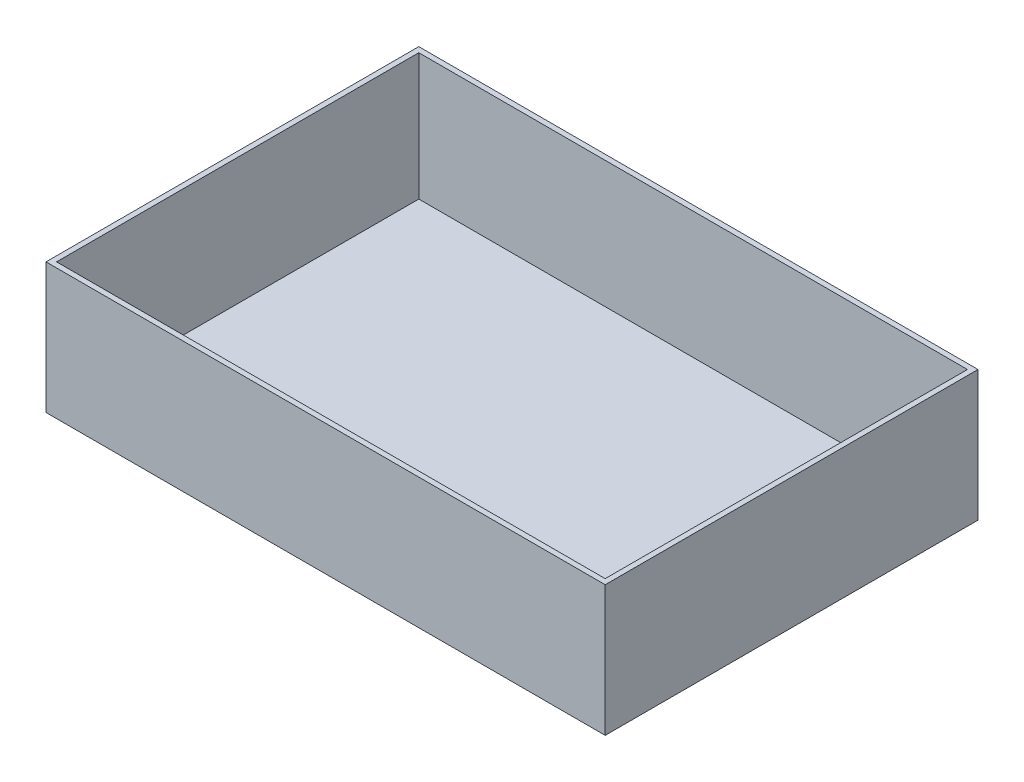
ISO-10303-21;
HEADER;
FILE_DESCRIPTION(('STEP AP214'),'2;1');
FILE_NAME('part.step','',(''),(''),'','','');
FILE_SCHEMA(('AUTOMOTIVE_DESIGN { 1 0 10303 214 1 1 1 1 }'));
ENDSEC;
DATA;
#1=APPLICATION_CONTEXT('core data for automotive mechanical design processes');
#2=APPLICATION_PROTOCOL_DEFINITION('international standard','automotive_design',2000,#1);
#3=PRODUCT_CONTEXT('',#1,'mechanical');
#4=PRODUCT('Part','Part','',(#3));
#5=PRODUCT_RELATED_PRODUCT_CATEGORY('part','',(#4));
#6=PRODUCT_DEFINITION_FORMATION('','',#4);
#7=PRODUCT_DEFINITION_CONTEXT('part definition',#1,'design');
#8=PRODUCT_DEFINITION('design','',#6,#7);
#9=PRODUCT_DEFINITION_SHAPE('','',#8);
#10=(LENGTH_UNIT() NAMED_UNIT(*) SI_UNIT(.MILLI.,.METRE.));
#11=(NAMED_UNIT(*) PLANE_ANGLE_UNIT() SI_UNIT($,.RADIAN.));
#12=(NAMED_UNIT(*) SI_UNIT($,.STERADIAN.) SOLID_ANGLE_UNIT());
#13=UNCERTAINTY_MEASURE_WITH_UNIT(LENGTH_MEASURE(1.E-05),#10,'distance_accuracy_value','');
#14=(GEOMETRIC_REPRESENTATION_CONTEXT(3) GLOBAL_UNCERTAINTY_ASSIGNED_CONTEXT((#13)) GLOBAL_UNIT_ASSIGNED_CONTEXT((#10,
#11,#12)) REPRESENTATION_CONTEXT('',''));
#15=CARTESIAN_POINT('',(0.,0.,0.));
#16=DIRECTION('',(0.,0.,1.));
#17=DIRECTION('',(1.,0.,0.));
#18=AXIS2_PLACEMENT_3D('',#15,#16,#17);
#19=CARTESIAN_POINT('',(0.,700.,0.));
#20=DIRECTION('',(0.,-1.,0.));
#21=DIRECTION('',(0.,0.,-1.));
#22=AXIS2_PLACEMENT_3D('',#19,#20,#21);
#23=PLANE('',#22);
#24=DIRECTION('',(0.,0.,1.));
#25=VECTOR('',#24,1.);
#26=CARTESIAN_POINT('',(0.,700.,0.));
#27=LINE('',#26,#25);
#28=CARTESIAN_POINT('',(0.,700.,-2000.));
#29=VERTEX_POINT('',#28);
#30=CARTESIAN_POINT('',(0.,700.,0.));
#31=VERTEX_POINT('',#30);
#32=EDGE_CURVE('E154',#29,#31,#27,.T.);
#33=ORIENTED_EDGE('',*,*,#32,.T.);
#34=DIRECTION('',(1.,0.,0.));
#35=VECTOR('',#34,1.);
#36=CARTESIAN_POINT('',(0.,700.,0.));
#37=LINE('',#36,#35);
#38=CARTESIAN_POINT('',(3000.,700.,0.));
#39=VERTEX_POINT('',#38);
#40=EDGE_CURVE('E158',#31,#39,#37,.T.);
#41=ORIENTED_EDGE('',*,*,#40,.T.);
#42=DIRECTION('',(0.,0.,-1.));
#43=VECTOR('',#42,1.);
#44=CARTESIAN_POINT('',(3000.,700.,0.));
#45=LINE('',#44,#43);
#46=CARTESIAN_POINT('',(3000.,700.,-2000.));
#47=VERTEX_POINT('',#46);
#48=EDGE_CURVE('E162',#39,#47,#45,.T.);
#49=ORIENTED_EDGE('',*,*,#48,.T.);
#50=DIRECTION('',(-1.,0.,0.));
#51=VECTOR('',#50,1.);
#52=CARTESIAN_POINT('',(0.,700.,-2000.));
#53=LINE('',#52,#51);
#54=EDGE_CURVE('E165',#47,#29,#53,.T.);
#55=ORIENTED_EDGE('',*,*,#54,.T.);
#56=EDGE_LOOP('',(#33,#41,#49,#55));
#57=FACE_BOUND('',#56,.T.);
#58=DIRECTION('',(0.,0.,-1.));
#59=VECTOR('',#58,1.);
#60=CARTESIAN_POINT('',(2971.71572875254,700.,-28.284271247462));
#61=LINE('',#60,#59);
#62=CARTESIAN_POINT('',(2971.71572875254,700.,-28.284271247462));
#63=VERTEX_POINT('',#62);
#64=CARTESIAN_POINT('',(2971.71572875254,700.,-1971.71572875254));
#65=VERTEX_POINT('',#64);
#66=EDGE_CURVE('E134',#63,#65,#61,.T.);
#67=ORIENTED_EDGE('',*,*,#66,.F.);
#68=DIRECTION('',(1.,0.,0.));
#69=VECTOR('',#68,1.);
#70=CARTESIAN_POINT('',(28.2842712474618,700.,-28.284271247462));
#71=LINE('',#70,#69);
#72=CARTESIAN_POINT('',(28.2842712474618,700.,-28.284271247462));
#73=VERTEX_POINT('',#72);
#74=EDGE_CURVE('E113',#73,#63,#71,.T.);
#75=ORIENTED_EDGE('',*,*,#74,.F.);
#76=DIRECTION('',(0.,0.,1.));
#77=VECTOR('',#76,1.);
#78=CARTESIAN_POINT('',(28.2842712474618,700.,-28.284271247462));
#79=LINE('',#78,#77);
#80=CARTESIAN_POINT('',(28.2842712474618,700.,-1971.71572875254));
#81=VERTEX_POINT('',#80);
#82=EDGE_CURVE('E140',#81,#73,#79,.T.);
#83=ORIENTED_EDGE('',*,*,#82,.F.);
#84=DIRECTION('',(-1.,0.,0.));
#85=VECTOR('',#84,1.);
#86=CARTESIAN_POINT('',(28.2842712474618,700.,-1971.71572875254));
#87=LINE('',#86,#85);
#88=EDGE_CURVE('E137',#65,#81,#87,.T.);
#89=ORIENTED_EDGE('',*,*,#88,.F.);
#90=EDGE_LOOP('',(#67,#75,#83,#89));
#91=FACE_BOUND('',#90,.T.);
#92=ADVANCED_FACE('F39',(#57,#91),#23,.F.);
#93=CARTESIAN_POINT('',(0.,0.,0.));
#94=DIRECTION('',(0.,-1.,0.));
#95=DIRECTION('',(0.,0.,-1.));
#96=AXIS2_PLACEMENT_3D('',#93,#94,#95);
#97=PLANE('',#96);
#98=DIRECTION('',(0.,0.,1.));
#99=VECTOR('',#98,1.);
#100=CARTESIAN_POINT('',(0.,0.,0.));
#101=LINE('',#100,#99);
#102=CARTESIAN_POINT('',(0.,0.,-2000.));
#103=VERTEX_POINT('',#102);
#104=CARTESIAN_POINT('',(0.,0.,0.));
#105=VERTEX_POINT('',#104);
#106=EDGE_CURVE('E153',#103,#105,#101,.T.);
#107=ORIENTED_EDGE('',*,*,#106,.F.);
#108=DIRECTION('',(-1.,0.,0.));
#109=VECTOR('',#108,1.);
#110=CARTESIAN_POINT('',(0.,0.,-2000.));
#111=LINE('',#110,#109);
#112=CARTESIAN_POINT('',(3000.,0.,-2000.));
#113=VERTEX_POINT('',#112);
#114=EDGE_CURVE('E159',#113,#103,#111,.T.);
#115=ORIENTED_EDGE('',*,*,#114,.F.);
#116=DIRECTION('',(0.,0.,-1.));
#117=VECTOR('',#116,1.);
#118=CARTESIAN_POINT('',(3000.,0.,0.));
#119=LINE('',#118,#117);
#120=CARTESIAN_POINT('',(3000.,0.,0.));
#121=VERTEX_POINT('',#120);
#122=EDGE_CURVE('E175',#121,#113,#119,.T.);
#123=ORIENTED_EDGE('',*,*,#122,.F.);
#124=DIRECTION('',(1.,0.,0.));
#125=VECTOR('',#124,1.);
#126=CARTESIAN_POINT('',(0.,0.,0.));
#127=LINE('',#126,#125);
#128=EDGE_CURVE('E172',#105,#121,#127,.T.);
#129=ORIENTED_EDGE('',*,*,#128,.F.);
#130=EDGE_LOOP('',(#107,#115,#123,#129));
#131=FACE_BOUND('',#130,.T.);
#132=ADVANCED_FACE('F198',(#131),#97,.T.);
#133=CARTESIAN_POINT('',(0.,700.,0.));
#134=DIRECTION('',(1.,0.,0.));
#135=DIRECTION('',(0.,0.,-1.));
#136=AXIS2_PLACEMENT_3D('',#133,#134,#135);
#137=PLANE('',#136);
#138=ORIENTED_EDGE('',*,*,#106,.T.);
#139=DIRECTION('',(0.,-1.,0.));
#140=VECTOR('',#139,1.);
#141=CARTESIAN_POINT('',(0.,700.,0.));
#142=LINE('',#141,#140);
#143=EDGE_CURVE('E11',#31,#105,#142,.T.);
#144=ORIENTED_EDGE('',*,*,#143,.F.);
#145=ORIENTED_EDGE('',*,*,#32,.F.);
#146=DIRECTION('',(0.,-1.,0.));
#147=VECTOR('',#146,1.);
#148=CARTESIAN_POINT('',(0.,700.,-2000.));
#149=LINE('',#148,#147);
#150=EDGE_CURVE('E168',#29,#103,#149,.T.);
#151=ORIENTED_EDGE('',*,*,#150,.T.);
#152=EDGE_LOOP('',(#138,#144,#145,#151));
#153=FACE_BOUND('',#152,.T.);
#154=ADVANCED_FACE('F41',(#153),#137,.F.);
#155=CARTESIAN_POINT('',(0.,700.,0.));
#156=DIRECTION('',(0.,0.,-1.));
#157=DIRECTION('',(-1.,0.,0.));
#158=AXIS2_PLACEMENT_3D('',#155,#156,#157);
#159=PLANE('',#158);
#160=ORIENTED_EDGE('',*,*,#128,.T.);
#161=DIRECTION('',(0.,-1.,0.));
#162=VECTOR('',#161,1.);
#163=CARTESIAN_POINT('',(3000.,700.,0.));
#164=LINE('',#163,#162);
#165=EDGE_CURVE('E48',#39,#121,#164,.T.);
#166=ORIENTED_EDGE('',*,*,#165,.F.);
#167=ORIENTED_EDGE('',*,*,#40,.F.);
#168=ORIENTED_EDGE('',*,*,#143,.T.);
#169=EDGE_LOOP('',(#160,#166,#167,#168));
#170=FACE_BOUND('',#169,.T.);
#171=ADVANCED_FACE('F208',(#170),#159,.F.);
#172=CARTESIAN_POINT('',(3000.,700.,0.));
#173=DIRECTION('',(-1.,0.,0.));
#174=DIRECTION('',(0.,0.,1.));
#175=AXIS2_PLACEMENT_3D('',#172,#173,#174);
#176=PLANE('',#175);
#177=ORIENTED_EDGE('',*,*,#122,.T.);
#178=DIRECTION('',(0.,-1.,0.));
#179=VECTOR('',#178,1.);
#180=CARTESIAN_POINT('',(3000.,700.,-2000.));
#181=LINE('',#180,#179);
#182=EDGE_CURVE('E183',#47,#113,#181,.T.);
#183=ORIENTED_EDGE('',*,*,#182,.F.);
#184=ORIENTED_EDGE('',*,*,#48,.F.);
#185=ORIENTED_EDGE('',*,*,#165,.T.);
#186=EDGE_LOOP('',(#177,#183,#184,#185));
#187=FACE_BOUND('',#186,.T.);
#188=ADVANCED_FACE('F192',(#187),#176,.F.);
#189=CARTESIAN_POINT('',(0.,700.,-2000.));
#190=DIRECTION('',(0.,0.,1.));
#191=DIRECTION('',(1.,0.,0.));
#192=AXIS2_PLACEMENT_3D('',#189,#190,#191);
#193=PLANE('',#192);
#194=ORIENTED_EDGE('',*,*,#114,.T.);
#195=ORIENTED_EDGE('',*,*,#150,.F.);
#196=ORIENTED_EDGE('',*,*,#54,.F.);
#197=ORIENTED_EDGE('',*,*,#182,.T.);
#198=EDGE_LOOP('',(#194,#195,#196,#197));
#199=FACE_BOUND('',#198,.T.);
#200=ADVANCED_FACE('F201',(#199),#193,.F.);
#201=CARTESIAN_POINT('',(2971.71572875254,700.,-28.284271247462));
#202=DIRECTION('',(-1.,0.,0.));
#203=DIRECTION('',(0.,0.,1.));
#204=AXIS2_PLACEMENT_3D('',#201,#202,#203);
#205=PLANE('',#204);
#206=DIRECTION('',(0.,0.,-1.));
#207=VECTOR('',#206,1.);
#208=CARTESIAN_POINT('',(2971.71572875254,20.,-1971.71572875254));
#209=LINE('',#208,#207);
#210=CARTESIAN_POINT('',(2971.71572875254,20.,-28.284271247462));
#211=VERTEX_POINT('',#210);
#212=CARTESIAN_POINT('',(2971.71572875254,20.,-1971.71572875254));
#213=VERTEX_POINT('',#212);
#214=EDGE_CURVE('E120',#211,#213,#209,.T.);
#215=ORIENTED_EDGE('',*,*,#214,.F.);
#216=DIRECTION('',(0.,-1.,0.));
#217=VECTOR('',#216,1.);
#218=CARTESIAN_POINT('',(2971.71572875254,700.,-28.284271247462));
#219=LINE('',#218,#217);
#220=EDGE_CURVE('E107',#63,#211,#219,.T.);
#221=ORIENTED_EDGE('',*,*,#220,.F.);
#222=ORIENTED_EDGE('',*,*,#66,.T.);
#223=DIRECTION('',(0.,-1.,0.));
#224=VECTOR('',#223,1.);
#225=CARTESIAN_POINT('',(2971.71572875254,700.,-1971.71572875254));
#226=LINE('',#225,#224);
#227=EDGE_CURVE('E122',#65,#213,#226,.T.);
#228=ORIENTED_EDGE('',*,*,#227,.T.);
#229=EDGE_LOOP('',(#215,#221,#222,#228));
#230=FACE_BOUND('',#229,.T.);
#231=ADVANCED_FACE('F121',(#230),#205,.T.);
#232=CARTESIAN_POINT('',(28.2842712474618,700.,-1971.71572875254));
#233=DIRECTION('',(0.,0.,1.));
#234=DIRECTION('',(1.,0.,0.));
#235=AXIS2_PLACEMENT_3D('',#232,#233,#234);
#236=PLANE('',#235);
#237=DIRECTION('',(-1.,0.,0.));
#238=VECTOR('',#237,1.);
#239=CARTESIAN_POINT('',(28.2842712474618,20.,-1971.71572875254));
#240=LINE('',#239,#238);
#241=CARTESIAN_POINT('',(28.2842712474618,20.,-1971.71572875254));
#242=VERTEX_POINT('',#241);
#243=EDGE_CURVE('E55',#213,#242,#240,.T.);
#244=ORIENTED_EDGE('',*,*,#243,.F.);
#245=ORIENTED_EDGE('',*,*,#227,.F.);
#246=ORIENTED_EDGE('',*,*,#88,.T.);
#247=DIRECTION('',(0.,-1.,0.));
#248=VECTOR('',#247,1.);
#249=CARTESIAN_POINT('',(28.2842712474618,700.,-1971.71572875254));
#250=LINE('',#249,#248);
#251=EDGE_CURVE('E148',#81,#242,#250,.T.);
#252=ORIENTED_EDGE('',*,*,#251,.T.);
#253=EDGE_LOOP('',(#244,#245,#246,#252));
#254=FACE_BOUND('',#253,.T.);
#255=ADVANCED_FACE('F228',(#254),#236,.T.);
#256=CARTESIAN_POINT('',(28.2842712474618,700.,-28.284271247462));
#257=DIRECTION('',(1.,0.,0.));
#258=DIRECTION('',(0.,0.,-1.));
#259=AXIS2_PLACEMENT_3D('',#256,#257,#258);
#260=PLANE('',#259);
#261=DIRECTION('',(0.,0.,1.));
#262=VECTOR('',#261,1.);
#263=CARTESIAN_POINT('',(28.2842712474618,20.,-1971.71572875254));
#264=LINE('',#263,#262);
#265=CARTESIAN_POINT('',(28.2842712474618,20.,-28.284271247462));
#266=VERTEX_POINT('',#265);
#267=EDGE_CURVE('E63',#242,#266,#264,.T.);
#268=ORIENTED_EDGE('',*,*,#267,.F.);
#269=ORIENTED_EDGE('',*,*,#251,.F.);
#270=ORIENTED_EDGE('',*,*,#82,.T.);
#271=DIRECTION('',(0.,-1.,0.));
#272=VECTOR('',#271,1.);
#273=CARTESIAN_POINT('',(28.2842712474618,700.,-28.284271247462));
#274=LINE('',#273,#272);
#275=EDGE_CURVE('E117',#73,#266,#274,.T.);
#276=ORIENTED_EDGE('',*,*,#275,.T.);
#277=EDGE_LOOP('',(#268,#269,#270,#276));
#278=FACE_BOUND('',#277,.T.);
#279=ADVANCED_FACE('F232',(#278),#260,.T.);
#280=CARTESIAN_POINT('',(28.2842712474618,700.,-28.284271247462));
#281=DIRECTION('',(0.,0.,-1.));
#282=DIRECTION('',(-1.,0.,0.));
#283=AXIS2_PLACEMENT_3D('',#280,#281,#282);
#284=PLANE('',#283);
#285=DIRECTION('',(1.,0.,0.));
#286=VECTOR('',#285,1.);
#287=CARTESIAN_POINT('',(28.2842712474618,20.,-28.284271247462));
#288=LINE('',#287,#286);
#289=EDGE_CURVE('E111',#266,#211,#288,.T.);
#290=ORIENTED_EDGE('',*,*,#289,.F.);
#291=ORIENTED_EDGE('',*,*,#275,.F.);
#292=ORIENTED_EDGE('',*,*,#74,.T.);
#293=ORIENTED_EDGE('',*,*,#220,.T.);
#294=EDGE_LOOP('',(#290,#291,#292,#293));
#295=FACE_BOUND('',#294,.T.);
#296=ADVANCED_FACE('F109',(#295),#284,.T.);
#297=CARTESIAN_POINT('',(0.,20.,0.));
#298=DIRECTION('',(0.,1.,0.));
#299=DIRECTION('',(0.,0.,1.));
#300=AXIS2_PLACEMENT_3D('',#297,#298,#299);
#301=PLANE('',#300);
#302=ORIENTED_EDGE('',*,*,#267,.T.);
#303=ORIENTED_EDGE('',*,*,#289,.T.);
#304=ORIENTED_EDGE('',*,*,#214,.T.);
#305=ORIENTED_EDGE('',*,*,#243,.T.);
#306=EDGE_LOOP('',(#302,#303,#304,#305));
#307=FACE_BOUND('',#306,.T.);
#308=ADVANCED_FACE('F126',(#307),#301,.T.);
#309=CLOSED_SHELL('',(#92,#132,#154,#171,#188,#200,#231,#255,#279,#296,#308));
#310=MANIFOLD_SOLID_BREP('B2',#309);
#311=ADVANCED_BREP_SHAPE_REPRESENTATION('',(#18,#310),#14);
#312=SHAPE_DEFINITION_REPRESENTATION(#9,#311);
ENDSEC;
END-ISO-10303-21;
